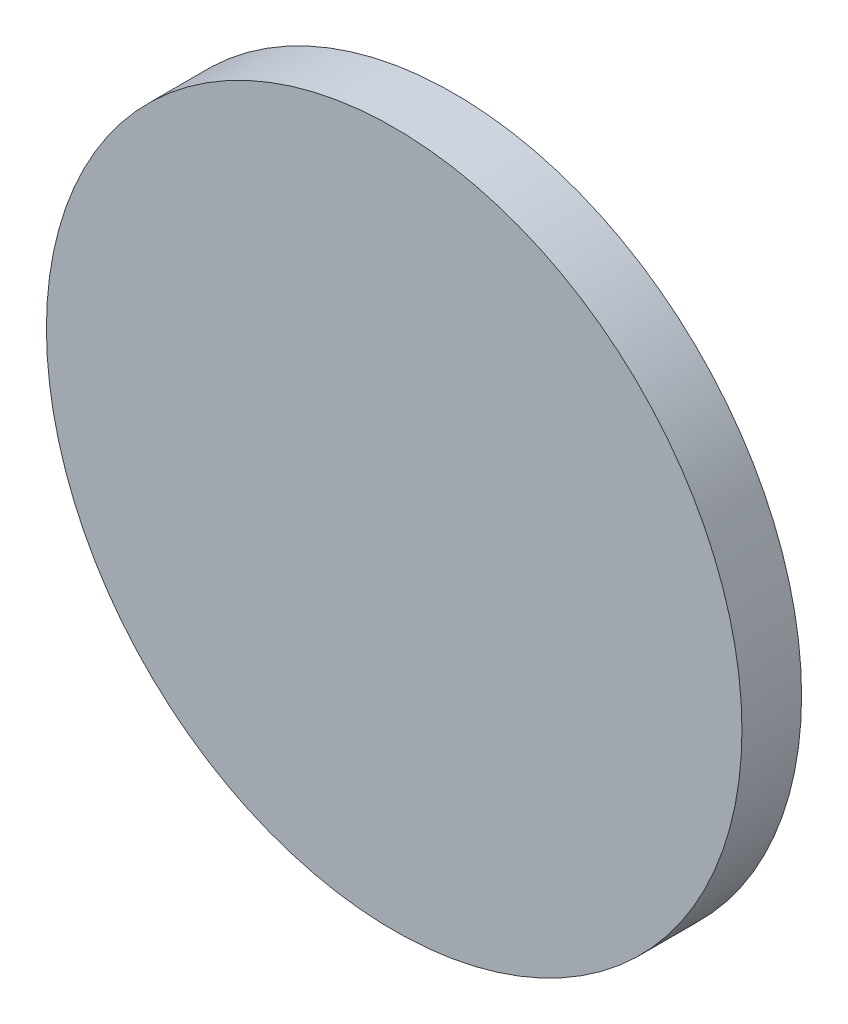
ISO-10303-21;
HEADER;
FILE_DESCRIPTION(('STEP AP214'),'2;1');
FILE_NAME('part.step','',(''),(''),'','','');
FILE_SCHEMA(('AUTOMOTIVE_DESIGN { 1 0 10303 214 1 1 1 1 }'));
ENDSEC;
DATA;
#1=APPLICATION_CONTEXT('core data for automotive mechanical design processes');
#2=APPLICATION_PROTOCOL_DEFINITION('international standard','automotive_design',2000,#1);
#3=PRODUCT_CONTEXT('',#1,'mechanical');
#4=PRODUCT('Part','Part','',(#3));
#5=PRODUCT_RELATED_PRODUCT_CATEGORY('part','',(#4));
#6=PRODUCT_DEFINITION_FORMATION('','',#4);
#7=PRODUCT_DEFINITION_CONTEXT('part definition',#1,'design');
#8=PRODUCT_DEFINITION('design','',#6,#7);
#9=PRODUCT_DEFINITION_SHAPE('','',#8);
#10=(LENGTH_UNIT() NAMED_UNIT(*) SI_UNIT(.MILLI.,.METRE.));
#11=(NAMED_UNIT(*) PLANE_ANGLE_UNIT() SI_UNIT($,.RADIAN.));
#12=(NAMED_UNIT(*) SI_UNIT($,.STERADIAN.) SOLID_ANGLE_UNIT());
#13=UNCERTAINTY_MEASURE_WITH_UNIT(LENGTH_MEASURE(1.E-05),#10,'distance_accuracy_value','');
#14=(GEOMETRIC_REPRESENTATION_CONTEXT(3) GLOBAL_UNCERTAINTY_ASSIGNED_CONTEXT((#13)) GLOBAL_UNIT_ASSIGNED_CONTEXT((#10,
#11,#12)) REPRESENTATION_CONTEXT('',''));
#15=CARTESIAN_POINT('',(0.,0.,0.));
#16=DIRECTION('',(0.,0.,1.));
#17=DIRECTION('',(1.,0.,0.));
#18=AXIS2_PLACEMENT_3D('',#15,#16,#17);
#19=CARTESIAN_POINT('',(1.72466,5.382260006176,0.03429));
#20=DIRECTION('',(0.,0.,1.));
#21=DIRECTION('',(1.,0.,0.));
#22=AXIS2_PLACEMENT_3D('',#19,#20,#21);
#23=PLANE('',#22);
#24=CARTESIAN_POINT('',(1.72466,5.382260006176,0.03429));
#25=DIRECTION('',(0.,0.,1.));
#26=DIRECTION('',(1.,0.,0.));
#27=AXIS2_PLACEMENT_3D('',#24,#25,#26);
#28=CIRCLE('',#27,0.200024667);
#29=CARTESIAN_POINT('',(1.924684667,5.382260006176,0.03429));
#30=VERTEX_POINT('',#29);
#31=EDGE_CURVE('E18',#30,#30,#28,.F.);
#32=ORIENTED_EDGE('',*,*,#31,.F.);
#33=EDGE_LOOP('',(#32));
#34=FACE_BOUND('',#33,.T.);
#35=ADVANCED_FACE('F15',(#34),#23,.T.);
#36=CARTESIAN_POINT('',(1.72466,5.382260006176,0.));
#37=DIRECTION('',(0.,0.,1.));
#38=DIRECTION('',(1.,0.,0.));
#39=AXIS2_PLACEMENT_3D('',#36,#37,#38);
#40=CYLINDRICAL_SURFACE('',#39,0.200024667);
#41=ORIENTED_EDGE('',*,*,#31,.T.);
#42=EDGE_LOOP('',(#41));
#43=FACE_BOUND('',#42,.T.);
#44=CARTESIAN_POINT('',(1.72466,5.382260006176,0.));
#45=DIRECTION('',(0.,0.,1.));
#46=DIRECTION('',(1.,0.,0.));
#47=AXIS2_PLACEMENT_3D('',#44,#45,#46);
#48=CIRCLE('',#47,0.200024667);
#49=CARTESIAN_POINT('',(1.924684667,5.382260006176,0.));
#50=VERTEX_POINT('',#49);
#51=EDGE_CURVE('E10',#50,#50,#48,.F.);
#52=ORIENTED_EDGE('',*,*,#51,.F.);
#53=EDGE_LOOP('',(#52));
#54=FACE_BOUND('',#53,.T.);
#55=ADVANCED_FACE('F27',(#43,#54),#40,.T.);
#56=CARTESIAN_POINT('',(1.72466,5.382260006176,0.));
#57=DIRECTION('',(0.,0.,-1.));
#58=DIRECTION('',(-1.,0.,0.));
#59=AXIS2_PLACEMENT_3D('',#56,#57,#58);
#60=PLANE('',#59);
#61=ORIENTED_EDGE('',*,*,#51,.T.);
#62=EDGE_LOOP('',(#61));
#63=FACE_BOUND('',#62,.T.);
#64=ADVANCED_FACE('F35',(#63),#60,.T.);
#65=CLOSED_SHELL('',(#35,#55,#64));
#66=MANIFOLD_SOLID_BREP('B1',#65);
#67=ADVANCED_BREP_SHAPE_REPRESENTATION('',(#18,#66),#14);
#68=SHAPE_DEFINITION_REPRESENTATION(#9,#67);
ENDSEC;
END-ISO-10303-21;
